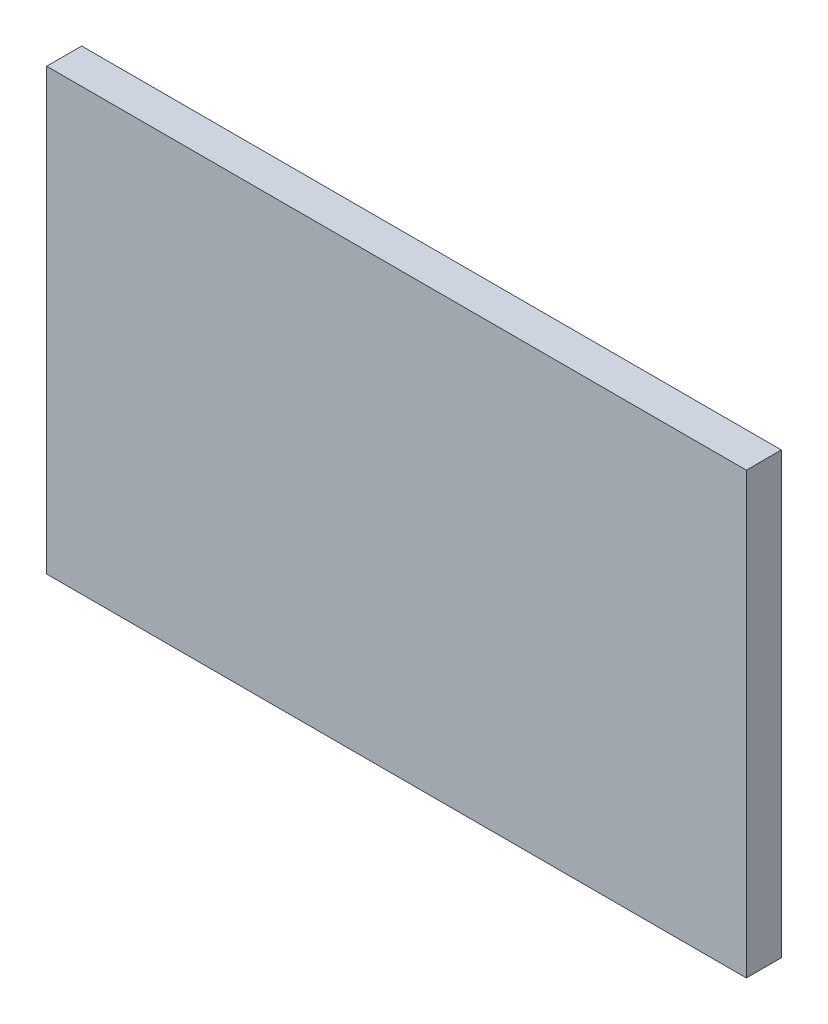
ISO-10303-21;
HEADER;
FILE_DESCRIPTION(('STEP AP214'),'2;1');
FILE_NAME('part.step','',(''),(''),'','','');
FILE_SCHEMA(('AUTOMOTIVE_DESIGN { 1 0 10303 214 1 1 1 1 }'));
ENDSEC;
DATA;
#1=APPLICATION_CONTEXT('core data for automotive mechanical design processes');
#2=APPLICATION_PROTOCOL_DEFINITION('international standard','automotive_design',2000,#1);
#3=PRODUCT_CONTEXT('',#1,'mechanical');
#4=PRODUCT('Part','Part','',(#3));
#5=PRODUCT_RELATED_PRODUCT_CATEGORY('part','',(#4));
#6=PRODUCT_DEFINITION_FORMATION('','',#4);
#7=PRODUCT_DEFINITION_CONTEXT('part definition',#1,'design');
#8=PRODUCT_DEFINITION('design','',#6,#7);
#9=PRODUCT_DEFINITION_SHAPE('','',#8);
#10=(LENGTH_UNIT() NAMED_UNIT(*) SI_UNIT(.MILLI.,.METRE.));
#11=(NAMED_UNIT(*) PLANE_ANGLE_UNIT() SI_UNIT($,.RADIAN.));
#12=(NAMED_UNIT(*) SI_UNIT($,.STERADIAN.) SOLID_ANGLE_UNIT());
#13=UNCERTAINTY_MEASURE_WITH_UNIT(LENGTH_MEASURE(1.E-05),#10,'distance_accuracy_value','');
#14=(GEOMETRIC_REPRESENTATION_CONTEXT(3) GLOBAL_UNCERTAINTY_ASSIGNED_CONTEXT((#13)) GLOBAL_UNIT_ASSIGNED_CONTEXT((#10,
#11,#12)) REPRESENTATION_CONTEXT('',''));
#15=CARTESIAN_POINT('',(0.,0.,0.));
#16=DIRECTION('',(0.,0.,1.));
#17=DIRECTION('',(1.,0.,0.));
#18=AXIS2_PLACEMENT_3D('',#15,#16,#17);
#19=CARTESIAN_POINT('',(-14.,8.8,1.4));
#20=DIRECTION('',(1.,0.,0.));
#21=DIRECTION('',(0.,1.,0.));
#22=AXIS2_PLACEMENT_3D('',#19,#20,#21);
#23=PLANE('',#22);
#24=DIRECTION('',(0.,-1.,0.));
#25=VECTOR('',#24,1.);
#26=CARTESIAN_POINT('',(-14.,8.8,0.));
#27=LINE('',#26,#25);
#28=CARTESIAN_POINT('',(-14.,8.8,0.));
#29=VERTEX_POINT('',#28);
#30=CARTESIAN_POINT('',(-14.,-8.8,0.));
#31=VERTEX_POINT('',#30);
#32=EDGE_CURVE('E98',#29,#31,#27,.T.);
#33=ORIENTED_EDGE('',*,*,#32,.T.);
#34=DIRECTION('',(0.,0.,-1.));
#35=VECTOR('',#34,1.);
#36=CARTESIAN_POINT('',(-14.,-8.8,1.4));
#37=LINE('',#36,#35);
#38=CARTESIAN_POINT('',(-14.,-8.8,1.4));
#39=VERTEX_POINT('',#38);
#40=EDGE_CURVE('E11',#39,#31,#37,.T.);
#41=ORIENTED_EDGE('',*,*,#40,.F.);
#42=DIRECTION('',(0.,-1.,0.));
#43=VECTOR('',#42,1.);
#44=CARTESIAN_POINT('',(-14.,8.8,1.4));
#45=LINE('',#44,#43);
#46=CARTESIAN_POINT('',(-14.,8.8,1.4));
#47=VERTEX_POINT('',#46);
#48=EDGE_CURVE('E86',#47,#39,#45,.T.);
#49=ORIENTED_EDGE('',*,*,#48,.F.);
#50=DIRECTION('',(0.,0.,-1.));
#51=VECTOR('',#50,1.);
#52=CARTESIAN_POINT('',(-14.,8.8,1.4));
#53=LINE('',#52,#51);
#54=EDGE_CURVE('E94',#47,#29,#53,.T.);
#55=ORIENTED_EDGE('',*,*,#54,.T.);
#56=EDGE_LOOP('',(#33,#41,#49,#55));
#57=FACE_BOUND('',#56,.T.);
#58=ADVANCED_FACE('F35',(#57),#23,.F.);
#59=CARTESIAN_POINT('',(14.,-8.8,1.4));
#60=DIRECTION('',(0.,1.,0.));
#61=DIRECTION('',(-1.,0.,0.));
#62=AXIS2_PLACEMENT_3D('',#59,#60,#61);
#63=PLANE('',#62);
#64=DIRECTION('',(1.,0.,0.));
#65=VECTOR('',#64,1.);
#66=CARTESIAN_POINT('',(14.,-8.8,0.));
#67=LINE('',#66,#65);
#68=CARTESIAN_POINT('',(14.,-8.8,0.));
#69=VERTEX_POINT('',#68);
#70=EDGE_CURVE('E90',#31,#69,#67,.T.);
#71=ORIENTED_EDGE('',*,*,#70,.T.);
#72=DIRECTION('',(0.,0.,-1.));
#73=VECTOR('',#72,1.);
#74=CARTESIAN_POINT('',(14.,-8.8,1.4));
#75=LINE('',#74,#73);
#76=CARTESIAN_POINT('',(14.,-8.8,1.4));
#77=VERTEX_POINT('',#76);
#78=EDGE_CURVE('E43',#77,#69,#75,.T.);
#79=ORIENTED_EDGE('',*,*,#78,.F.);
#80=DIRECTION('',(1.,0.,0.));
#81=VECTOR('',#80,1.);
#82=CARTESIAN_POINT('',(14.,-8.8,1.4));
#83=LINE('',#82,#81);
#84=EDGE_CURVE('E81',#39,#77,#83,.T.);
#85=ORIENTED_EDGE('',*,*,#84,.F.);
#86=ORIENTED_EDGE('',*,*,#40,.T.);
#87=EDGE_LOOP('',(#71,#79,#85,#86));
#88=FACE_BOUND('',#87,.T.);
#89=ADVANCED_FACE('F89',(#88),#63,.F.);
#90=CARTESIAN_POINT('',(14.,8.8,1.4));
#91=DIRECTION('',(-1.,0.,0.));
#92=DIRECTION('',(0.,-1.,0.));
#93=AXIS2_PLACEMENT_3D('',#90,#91,#92);
#94=PLANE('',#93);
#95=DIRECTION('',(0.,1.,0.));
#96=VECTOR('',#95,1.);
#97=CARTESIAN_POINT('',(14.,8.8,0.));
#98=LINE('',#97,#96);
#99=CARTESIAN_POINT('',(14.,8.8,0.));
#100=VERTEX_POINT('',#99);
#101=EDGE_CURVE('E68',#69,#100,#98,.T.);
#102=ORIENTED_EDGE('',*,*,#101,.T.);
#103=DIRECTION('',(0.,0.,-1.));
#104=VECTOR('',#103,1.);
#105=CARTESIAN_POINT('',(14.,8.8,1.4));
#106=LINE('',#105,#104);
#107=CARTESIAN_POINT('',(14.,8.8,1.4));
#108=VERTEX_POINT('',#107);
#109=EDGE_CURVE('E91',#108,#100,#106,.T.);
#110=ORIENTED_EDGE('',*,*,#109,.F.);
#111=DIRECTION('',(0.,1.,0.));
#112=VECTOR('',#111,1.);
#113=CARTESIAN_POINT('',(14.,8.8,1.4));
#114=LINE('',#113,#112);
#115=EDGE_CURVE('E84',#77,#108,#114,.T.);
#116=ORIENTED_EDGE('',*,*,#115,.F.);
#117=ORIENTED_EDGE('',*,*,#78,.T.);
#118=EDGE_LOOP('',(#102,#110,#116,#117));
#119=FACE_BOUND('',#118,.T.);
#120=ADVANCED_FACE('F92',(#119),#94,.F.);
#121=CARTESIAN_POINT('',(14.,8.8,1.4));
#122=DIRECTION('',(0.,-1.,0.));
#123=DIRECTION('',(1.,0.,0.));
#124=AXIS2_PLACEMENT_3D('',#121,#122,#123);
#125=PLANE('',#124);
#126=DIRECTION('',(-1.,0.,0.));
#127=VECTOR('',#126,1.);
#128=CARTESIAN_POINT('',(14.,8.8,0.));
#129=LINE('',#128,#127);
#130=EDGE_CURVE('E74',#100,#29,#129,.T.);
#131=ORIENTED_EDGE('',*,*,#130,.T.);
#132=ORIENTED_EDGE('',*,*,#54,.F.);
#133=DIRECTION('',(-1.,0.,0.));
#134=VECTOR('',#133,1.);
#135=CARTESIAN_POINT('',(14.,8.8,1.4));
#136=LINE('',#135,#134);
#137=EDGE_CURVE('E51',#108,#47,#136,.T.);
#138=ORIENTED_EDGE('',*,*,#137,.F.);
#139=ORIENTED_EDGE('',*,*,#109,.T.);
#140=EDGE_LOOP('',(#131,#132,#138,#139));
#141=FACE_BOUND('',#140,.T.);
#142=ADVANCED_FACE('F105',(#141),#125,.F.);
#143=CARTESIAN_POINT('',(0.,0.,1.4));
#144=DIRECTION('',(0.,0.,-1.));
#145=DIRECTION('',(-1.,0.,0.));
#146=AXIS2_PLACEMENT_3D('',#143,#144,#145);
#147=PLANE('',#146);
#148=ORIENTED_EDGE('',*,*,#48,.T.);
#149=ORIENTED_EDGE('',*,*,#84,.T.);
#150=ORIENTED_EDGE('',*,*,#115,.T.);
#151=ORIENTED_EDGE('',*,*,#137,.T.);
#152=EDGE_LOOP('',(#148,#149,#150,#151));
#153=FACE_BOUND('',#152,.T.);
#154=ADVANCED_FACE('F82',(#153),#147,.F.);
#155=CARTESIAN_POINT('',(0.,0.,0.));
#156=DIRECTION('',(0.,0.,-1.));
#157=DIRECTION('',(-1.,0.,0.));
#158=AXIS2_PLACEMENT_3D('',#155,#156,#157);
#159=PLANE('',#158);
#160=ORIENTED_EDGE('',*,*,#32,.F.);
#161=ORIENTED_EDGE('',*,*,#130,.F.);
#162=ORIENTED_EDGE('',*,*,#101,.F.);
#163=ORIENTED_EDGE('',*,*,#70,.F.);
#164=EDGE_LOOP('',(#160,#161,#162,#163));
#165=FACE_BOUND('',#164,.T.);
#166=ADVANCED_FACE('F108',(#165),#159,.T.);
#167=CLOSED_SHELL('',(#58,#89,#120,#142,#154,#166));
#168=MANIFOLD_SOLID_BREP('B2',#167);
#169=ADVANCED_BREP_SHAPE_REPRESENTATION('',(#18,#168),#14);
#170=SHAPE_DEFINITION_REPRESENTATION(#9,#169);
ENDSEC;
END-ISO-10303-21;
